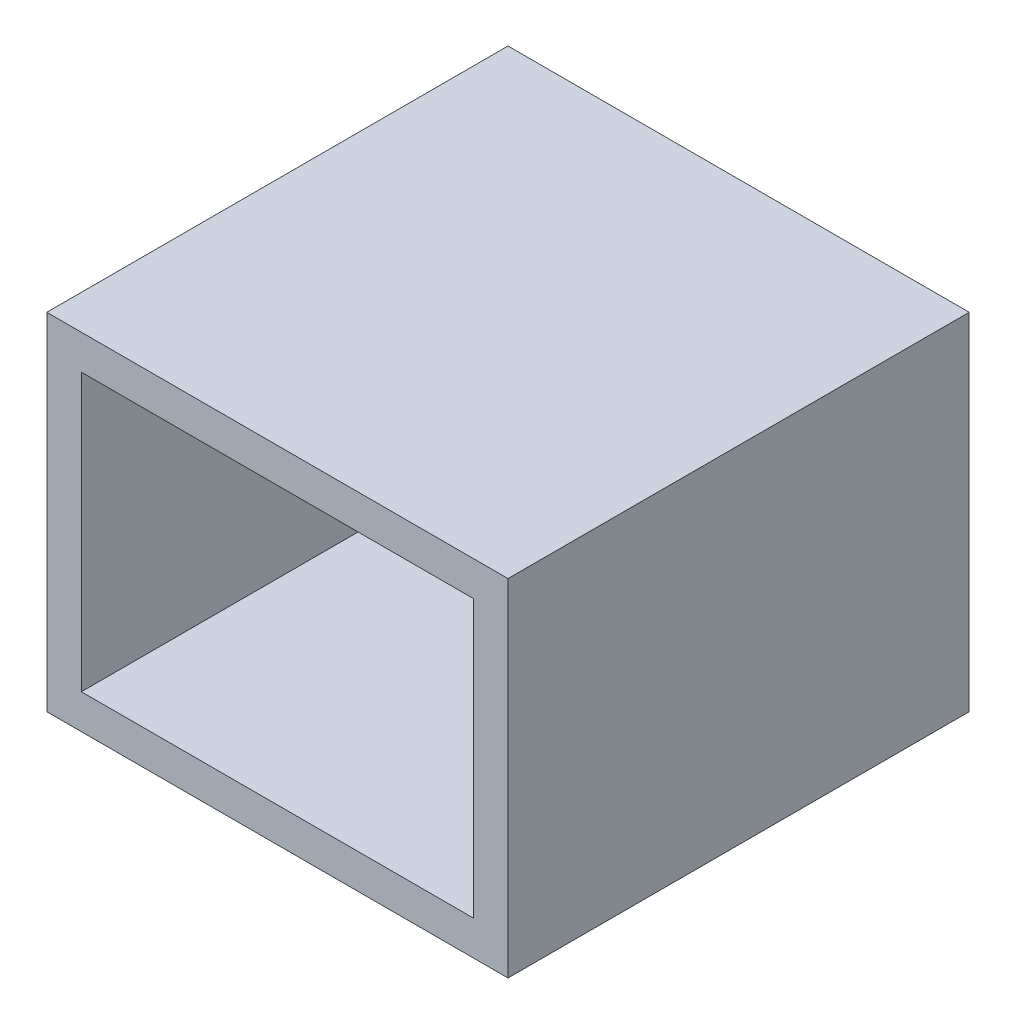
ISO-10303-21;
HEADER;
FILE_DESCRIPTION(('STEP AP214'),'2;1');
FILE_NAME('part.step','',(''),(''),'','','');
FILE_SCHEMA(('AUTOMOTIVE_DESIGN { 1 0 10303 214 1 1 1 1 }'));
ENDSEC;
DATA;
#1=APPLICATION_CONTEXT('core data for automotive mechanical design processes');
#2=APPLICATION_PROTOCOL_DEFINITION('international standard','automotive_design',2000,#1);
#3=PRODUCT_CONTEXT('',#1,'mechanical');
#4=PRODUCT('Part','Part','',(#3));
#5=PRODUCT_RELATED_PRODUCT_CATEGORY('part','',(#4));
#6=PRODUCT_DEFINITION_FORMATION('','',#4);
#7=PRODUCT_DEFINITION_CONTEXT('part definition',#1,'design');
#8=PRODUCT_DEFINITION('design','',#6,#7);
#9=PRODUCT_DEFINITION_SHAPE('','',#8);
#10=(LENGTH_UNIT() NAMED_UNIT(*) SI_UNIT(.MILLI.,.METRE.));
#11=(NAMED_UNIT(*) PLANE_ANGLE_UNIT() SI_UNIT($,.RADIAN.));
#12=(NAMED_UNIT(*) SI_UNIT($,.STERADIAN.) SOLID_ANGLE_UNIT());
#13=UNCERTAINTY_MEASURE_WITH_UNIT(LENGTH_MEASURE(1.E-05),#10,'distance_accuracy_value','');
#14=(GEOMETRIC_REPRESENTATION_CONTEXT(3) GLOBAL_UNCERTAINTY_ASSIGNED_CONTEXT((#13)) GLOBAL_UNIT_ASSIGNED_CONTEXT((#10,
#11,#12)) REPRESENTATION_CONTEXT('',''));
#15=CARTESIAN_POINT('',(0.,0.,0.));
#16=DIRECTION('',(0.,0.,1.));
#17=DIRECTION('',(1.,0.,0.));
#18=AXIS2_PLACEMENT_3D('',#15,#16,#17);
#19=CARTESIAN_POINT('',(-13.6697247706422,31.3142201834862,40.));
#20=DIRECTION('',(1.,0.,0.));
#21=DIRECTION('',(0.,1.,0.));
#22=AXIS2_PLACEMENT_3D('',#19,#20,#21);
#23=PLANE('',#22);
#24=DIRECTION('',(0.,-1.,0.));
#25=VECTOR('',#24,1.);
#26=CARTESIAN_POINT('',(-13.6697247706422,31.3142201834862,0.));
#27=LINE('',#26,#25);
#28=CARTESIAN_POINT('',(-13.6697247706422,31.3142201834862,0.));
#29=VERTEX_POINT('',#28);
#30=CARTESIAN_POINT('',(-13.6697247706422,1.31422018348624,0.));
#31=VERTEX_POINT('',#30);
#32=EDGE_CURVE('E164',#29,#31,#27,.T.);
#33=ORIENTED_EDGE('',*,*,#32,.T.);
#34=DIRECTION('',(0.,0.,-1.));
#35=VECTOR('',#34,1.);
#36=CARTESIAN_POINT('',(-13.6697247706422,1.31422018348624,40.));
#37=LINE('',#36,#35);
#38=CARTESIAN_POINT('',(-13.6697247706422,1.31422018348624,40.));
#39=VERTEX_POINT('',#38);
#40=EDGE_CURVE('E11',#39,#31,#37,.T.);
#41=ORIENTED_EDGE('',*,*,#40,.F.);
#42=DIRECTION('',(0.,-1.,0.));
#43=VECTOR('',#42,1.);
#44=CARTESIAN_POINT('',(-13.6697247706422,31.3142201834862,40.));
#45=LINE('',#44,#43);
#46=CARTESIAN_POINT('',(-13.6697247706422,31.3142201834862,40.));
#47=VERTEX_POINT('',#46);
#48=EDGE_CURVE('E170',#47,#39,#45,.T.);
#49=ORIENTED_EDGE('',*,*,#48,.F.);
#50=DIRECTION('',(0.,0.,-1.));
#51=VECTOR('',#50,1.);
#52=CARTESIAN_POINT('',(-13.6697247706422,31.3142201834862,40.));
#53=LINE('',#52,#51);
#54=EDGE_CURVE('E180',#47,#29,#53,.T.);
#55=ORIENTED_EDGE('',*,*,#54,.T.);
#56=EDGE_LOOP('',(#33,#41,#49,#55));
#57=FACE_BOUND('',#56,.T.);
#58=ADVANCED_FACE('F45',(#57),#23,.F.);
#59=CARTESIAN_POINT('',(-13.6697247706422,1.31422018348624,40.));
#60=DIRECTION('',(0.,1.,0.));
#61=DIRECTION('',(0.,0.,1.));
#62=AXIS2_PLACEMENT_3D('',#59,#60,#61);
#63=PLANE('',#62);
#64=DIRECTION('',(1.,0.,0.));
#65=VECTOR('',#64,1.);
#66=CARTESIAN_POINT('',(-13.6697247706422,1.31422018348624,0.));
#67=LINE('',#66,#65);
#68=CARTESIAN_POINT('',(26.3302752293578,1.31422018348624,0.));
#69=VERTEX_POINT('',#68);
#70=EDGE_CURVE('E184',#31,#69,#67,.T.);
#71=ORIENTED_EDGE('',*,*,#70,.T.);
#72=DIRECTION('',(0.,0.,-1.));
#73=VECTOR('',#72,1.);
#74=CARTESIAN_POINT('',(26.3302752293578,1.31422018348624,40.));
#75=LINE('',#74,#73);
#76=CARTESIAN_POINT('',(26.3302752293578,1.31422018348624,40.));
#77=VERTEX_POINT('',#76);
#78=EDGE_CURVE('E53',#77,#69,#75,.T.);
#79=ORIENTED_EDGE('',*,*,#78,.F.);
#80=DIRECTION('',(1.,0.,0.));
#81=VECTOR('',#80,1.);
#82=CARTESIAN_POINT('',(-13.6697247706422,1.31422018348624,40.));
#83=LINE('',#82,#81);
#84=EDGE_CURVE('E97',#39,#77,#83,.T.);
#85=ORIENTED_EDGE('',*,*,#84,.F.);
#86=ORIENTED_EDGE('',*,*,#40,.T.);
#87=EDGE_LOOP('',(#71,#79,#85,#86));
#88=FACE_BOUND('',#87,.T.);
#89=ADVANCED_FACE('F220',(#88),#63,.F.);
#90=CARTESIAN_POINT('',(26.3302752293578,31.3142201834862,40.));
#91=DIRECTION('',(-1.,0.,0.));
#92=DIRECTION('',(0.,-1.,0.));
#93=AXIS2_PLACEMENT_3D('',#90,#91,#92);
#94=PLANE('',#93);
#95=DIRECTION('',(0.,1.,0.));
#96=VECTOR('',#95,1.);
#97=CARTESIAN_POINT('',(26.3302752293578,31.3142201834862,0.));
#98=LINE('',#97,#96);
#99=CARTESIAN_POINT('',(26.3302752293578,31.3142201834862,0.));
#100=VERTEX_POINT('',#99);
#101=EDGE_CURVE('E187',#69,#100,#98,.T.);
#102=ORIENTED_EDGE('',*,*,#101,.T.);
#103=DIRECTION('',(0.,0.,-1.));
#104=VECTOR('',#103,1.);
#105=CARTESIAN_POINT('',(26.3302752293578,31.3142201834862,40.));
#106=LINE('',#105,#104);
#107=CARTESIAN_POINT('',(26.3302752293578,31.3142201834862,40.));
#108=VERTEX_POINT('',#107);
#109=EDGE_CURVE('E194',#108,#100,#106,.T.);
#110=ORIENTED_EDGE('',*,*,#109,.F.);
#111=DIRECTION('',(0.,1.,0.));
#112=VECTOR('',#111,1.);
#113=CARTESIAN_POINT('',(26.3302752293578,31.3142201834862,40.));
#114=LINE('',#113,#112);
#115=EDGE_CURVE('E175',#77,#108,#114,.T.);
#116=ORIENTED_EDGE('',*,*,#115,.F.);
#117=ORIENTED_EDGE('',*,*,#78,.T.);
#118=EDGE_LOOP('',(#102,#110,#116,#117));
#119=FACE_BOUND('',#118,.T.);
#120=ADVANCED_FACE('F201',(#119),#94,.F.);
#121=CARTESIAN_POINT('',(-13.6697247706422,31.3142201834862,40.));
#122=DIRECTION('',(0.,-1.,0.));
#123=DIRECTION('',(0.,0.,-1.));
#124=AXIS2_PLACEMENT_3D('',#121,#122,#123);
#125=PLANE('',#124);
#126=DIRECTION('',(-1.,0.,0.));
#127=VECTOR('',#126,1.);
#128=CARTESIAN_POINT('',(-13.6697247706422,31.3142201834862,0.));
#129=LINE('',#128,#127);
#130=EDGE_CURVE('E90',#100,#29,#129,.T.);
#131=ORIENTED_EDGE('',*,*,#130,.T.);
#132=ORIENTED_EDGE('',*,*,#54,.F.);
#133=DIRECTION('',(-1.,0.,0.));
#134=VECTOR('',#133,1.);
#135=CARTESIAN_POINT('',(-13.6697247706422,31.3142201834862,40.));
#136=LINE('',#135,#134);
#137=EDGE_CURVE('E69',#108,#47,#136,.T.);
#138=ORIENTED_EDGE('',*,*,#137,.F.);
#139=ORIENTED_EDGE('',*,*,#109,.T.);
#140=EDGE_LOOP('',(#131,#132,#138,#139));
#141=FACE_BOUND('',#140,.T.);
#142=ADVANCED_FACE('F209',(#141),#125,.F.);
#143=CARTESIAN_POINT('',(0.,0.,40.));
#144=DIRECTION('',(0.,0.,1.));
#145=DIRECTION('',(1.,0.,0.));
#146=AXIS2_PLACEMENT_3D('',#143,#144,#145);
#147=PLANE('',#146);
#148=DIRECTION('',(-1.,0.,0.));
#149=VECTOR('',#148,1.);
#150=CARTESIAN_POINT('',(-10.6697247706422,28.3142201834862,40.));
#151=LINE('',#150,#149);
#152=CARTESIAN_POINT('',(23.3302752293578,28.3142201834862,40.));
#153=VERTEX_POINT('',#152);
#154=CARTESIAN_POINT('',(-10.6697247706422,28.3142201834862,40.));
#155=VERTEX_POINT('',#154);
#156=EDGE_CURVE('E60',#153,#155,#151,.T.);
#157=ORIENTED_EDGE('',*,*,#156,.F.);
#158=DIRECTION('',(0.,1.,0.));
#159=VECTOR('',#158,1.);
#160=CARTESIAN_POINT('',(23.3302752293578,28.3142201834862,40.));
#161=LINE('',#160,#159);
#162=CARTESIAN_POINT('',(23.3302752293578,4.31422018348624,40.));
#163=VERTEX_POINT('',#162);
#164=EDGE_CURVE('E142',#163,#153,#161,.T.);
#165=ORIENTED_EDGE('',*,*,#164,.F.);
#166=DIRECTION('',(1.,0.,0.));
#167=VECTOR('',#166,1.);
#168=CARTESIAN_POINT('',(-10.6697247706422,4.31422018348624,40.));
#169=LINE('',#168,#167);
#170=CARTESIAN_POINT('',(-10.6697247706422,4.31422018348624,40.));
#171=VERTEX_POINT('',#170);
#172=EDGE_CURVE('E146',#171,#163,#169,.T.);
#173=ORIENTED_EDGE('',*,*,#172,.F.);
#174=DIRECTION('',(0.,-1.,0.));
#175=VECTOR('',#174,1.);
#176=CARTESIAN_POINT('',(-10.6697247706422,28.3142201834862,40.));
#177=LINE('',#176,#175);
#178=EDGE_CURVE('E155',#155,#171,#177,.T.);
#179=ORIENTED_EDGE('',*,*,#178,.F.);
#180=EDGE_LOOP('',(#157,#165,#173,#179));
#181=FACE_BOUND('',#180,.T.);
#182=ORIENTED_EDGE('',*,*,#48,.T.);
#183=ORIENTED_EDGE('',*,*,#84,.T.);
#184=ORIENTED_EDGE('',*,*,#115,.T.);
#185=ORIENTED_EDGE('',*,*,#137,.T.);
#186=EDGE_LOOP('',(#182,#183,#184,#185));
#187=FACE_BOUND('',#186,.T.);
#188=ADVANCED_FACE('F211',(#181,#187),#147,.T.);
#189=CARTESIAN_POINT('',(0.,0.,0.));
#190=DIRECTION('',(0.,0.,1.));
#191=DIRECTION('',(1.,0.,0.));
#192=AXIS2_PLACEMENT_3D('',#189,#190,#191);
#193=PLANE('',#192);
#194=ORIENTED_EDGE('',*,*,#32,.F.);
#195=ORIENTED_EDGE('',*,*,#130,.F.);
#196=ORIENTED_EDGE('',*,*,#101,.F.);
#197=ORIENTED_EDGE('',*,*,#70,.F.);
#198=EDGE_LOOP('',(#194,#195,#196,#197));
#199=FACE_BOUND('',#198,.T.);
#200=ADVANCED_FACE('F205',(#199),#193,.F.);
#201=CARTESIAN_POINT('',(-10.6697247706422,28.3142201834862,3.));
#202=DIRECTION('',(0.,1.,0.));
#203=DIRECTION('',(0.,0.,1.));
#204=AXIS2_PLACEMENT_3D('',#201,#202,#203);
#205=PLANE('',#204);
#206=ORIENTED_EDGE('',*,*,#156,.T.);
#207=DIRECTION('',(0.,0.,1.));
#208=VECTOR('',#207,1.);
#209=CARTESIAN_POINT('',(-10.6697247706422,28.3142201834862,3.));
#210=LINE('',#209,#208);
#211=CARTESIAN_POINT('',(-10.6697247706422,28.3142201834862,3.));
#212=VERTEX_POINT('',#211);
#213=EDGE_CURVE('E117',#212,#155,#210,.T.);
#214=ORIENTED_EDGE('',*,*,#213,.F.);
#215=DIRECTION('',(-1.,0.,0.));
#216=VECTOR('',#215,1.);
#217=CARTESIAN_POINT('',(-10.6697247706422,28.3142201834862,3.));
#218=LINE('',#217,#216);
#219=CARTESIAN_POINT('',(23.3302752293578,28.3142201834862,3.));
#220=VERTEX_POINT('',#219);
#221=EDGE_CURVE('E121',#220,#212,#218,.T.);
#222=ORIENTED_EDGE('',*,*,#221,.F.);
#223=DIRECTION('',(0.,0.,1.));
#224=VECTOR('',#223,1.);
#225=CARTESIAN_POINT('',(23.3302752293578,28.3142201834862,3.));
#226=LINE('',#225,#224);
#227=EDGE_CURVE('E161',#220,#153,#226,.T.);
#228=ORIENTED_EDGE('',*,*,#227,.T.);
#229=EDGE_LOOP('',(#206,#214,#222,#228));
#230=FACE_BOUND('',#229,.T.);
#231=ADVANCED_FACE('F119',(#230),#205,.F.);
#232=CARTESIAN_POINT('',(23.3302752293578,28.3142201834862,3.));
#233=DIRECTION('',(1.,0.,0.));
#234=DIRECTION('',(0.,0.,-1.));
#235=AXIS2_PLACEMENT_3D('',#232,#233,#234);
#236=PLANE('',#235);
#237=ORIENTED_EDGE('',*,*,#164,.T.);
#238=ORIENTED_EDGE('',*,*,#227,.F.);
#239=DIRECTION('',(0.,1.,0.));
#240=VECTOR('',#239,1.);
#241=CARTESIAN_POINT('',(23.3302752293578,28.3142201834862,3.));
#242=LINE('',#241,#240);
#243=CARTESIAN_POINT('',(23.3302752293578,4.31422018348624,3.));
#244=VERTEX_POINT('',#243);
#245=EDGE_CURVE('E128',#244,#220,#242,.T.);
#246=ORIENTED_EDGE('',*,*,#245,.F.);
#247=DIRECTION('',(0.,0.,1.));
#248=VECTOR('',#247,1.);
#249=CARTESIAN_POINT('',(23.3302752293578,4.31422018348624,3.));
#250=LINE('',#249,#248);
#251=EDGE_CURVE('E165',#244,#163,#250,.T.);
#252=ORIENTED_EDGE('',*,*,#251,.T.);
#253=EDGE_LOOP('',(#237,#238,#246,#252));
#254=FACE_BOUND('',#253,.T.);
#255=ADVANCED_FACE('F260',(#254),#236,.F.);
#256=CARTESIAN_POINT('',(-10.6697247706422,4.31422018348624,3.));
#257=DIRECTION('',(0.,-1.,0.));
#258=DIRECTION('',(1.,0.,0.));
#259=AXIS2_PLACEMENT_3D('',#256,#257,#258);
#260=PLANE('',#259);
#261=ORIENTED_EDGE('',*,*,#172,.T.);
#262=ORIENTED_EDGE('',*,*,#251,.F.);
#263=DIRECTION('',(1.,0.,0.));
#264=VECTOR('',#263,1.);
#265=CARTESIAN_POINT('',(-10.6697247706422,4.31422018348624,3.));
#266=LINE('',#265,#264);
#267=CARTESIAN_POINT('',(-10.6697247706422,4.31422018348624,3.));
#268=VERTEX_POINT('',#267);
#269=EDGE_CURVE('E137',#268,#244,#266,.T.);
#270=ORIENTED_EDGE('',*,*,#269,.F.);
#271=DIRECTION('',(0.,0.,1.));
#272=VECTOR('',#271,1.);
#273=CARTESIAN_POINT('',(-10.6697247706422,4.31422018348624,3.));
#274=LINE('',#273,#272);
#275=EDGE_CURVE('E127',#268,#171,#274,.T.);
#276=ORIENTED_EDGE('',*,*,#275,.T.);
#277=EDGE_LOOP('',(#261,#262,#270,#276));
#278=FACE_BOUND('',#277,.T.);
#279=ADVANCED_FACE('F269',(#278),#260,.F.);
#280=CARTESIAN_POINT('',(-10.6697247706422,28.3142201834862,3.));
#281=DIRECTION('',(-1.,0.,0.));
#282=DIRECTION('',(0.,0.,1.));
#283=AXIS2_PLACEMENT_3D('',#280,#281,#282);
#284=PLANE('',#283);
#285=ORIENTED_EDGE('',*,*,#178,.T.);
#286=ORIENTED_EDGE('',*,*,#275,.F.);
#287=DIRECTION('',(0.,-1.,0.));
#288=VECTOR('',#287,1.);
#289=CARTESIAN_POINT('',(-10.6697247706422,28.3142201834862,3.));
#290=LINE('',#289,#288);
#291=EDGE_CURVE('E131',#212,#268,#290,.T.);
#292=ORIENTED_EDGE('',*,*,#291,.F.);
#293=ORIENTED_EDGE('',*,*,#213,.T.);
#294=EDGE_LOOP('',(#285,#286,#292,#293));
#295=FACE_BOUND('',#294,.T.);
#296=ADVANCED_FACE('F132',(#295),#284,.F.);
#297=CARTESIAN_POINT('',(0.,0.,3.));
#298=DIRECTION('',(0.,0.,-1.));
#299=DIRECTION('',(-1.,0.,0.));
#300=AXIS2_PLACEMENT_3D('',#297,#298,#299);
#301=PLANE('',#300);
#302=ORIENTED_EDGE('',*,*,#221,.T.);
#303=ORIENTED_EDGE('',*,*,#291,.T.);
#304=ORIENTED_EDGE('',*,*,#269,.T.);
#305=ORIENTED_EDGE('',*,*,#245,.T.);
#306=EDGE_LOOP('',(#302,#303,#304,#305));
#307=FACE_BOUND('',#306,.T.);
#308=ADVANCED_FACE('F139',(#307),#301,.F.);
#309=CLOSED_SHELL('',(#58,#89,#120,#142,#188,#200,#231,#255,#279,#296,#308));
#310=MANIFOLD_SOLID_BREP('B2',#309);
#311=ADVANCED_BREP_SHAPE_REPRESENTATION('',(#18,#310),#14);
#312=SHAPE_DEFINITION_REPRESENTATION(#9,#311);
ENDSEC;
END-ISO-10303-21;
